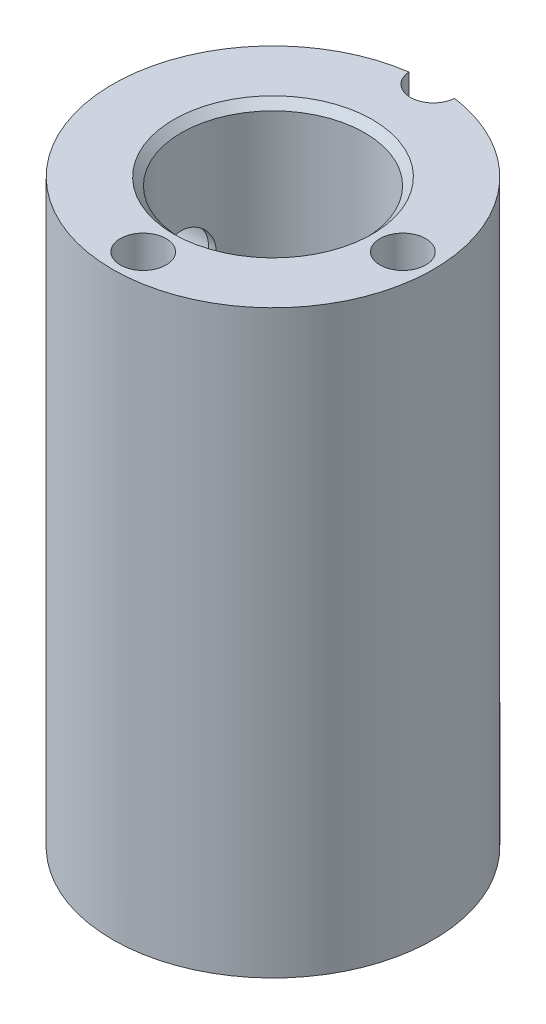
ISO-10303-21;
HEADER;
FILE_DESCRIPTION(('STEP AP214'),'2;1');
FILE_NAME('part.step','',(''),(''),'','','');
FILE_SCHEMA(('AUTOMOTIVE_DESIGN { 1 0 10303 214 1 1 1 1 }'));
ENDSEC;
DATA;
#1=APPLICATION_CONTEXT('core data for automotive mechanical design processes');
#2=APPLICATION_PROTOCOL_DEFINITION('international standard','automotive_design',2000,#1);
#3=PRODUCT_CONTEXT('',#1,'mechanical');
#4=PRODUCT('Part','Part','',(#3));
#5=PRODUCT_RELATED_PRODUCT_CATEGORY('part','',(#4));
#6=PRODUCT_DEFINITION_FORMATION('','',#4);
#7=PRODUCT_DEFINITION_CONTEXT('part definition',#1,'design');
#8=PRODUCT_DEFINITION('design','',#6,#7);
#9=PRODUCT_DEFINITION_SHAPE('','',#8);
#10=(LENGTH_UNIT() NAMED_UNIT(*) SI_UNIT(.MILLI.,.METRE.));
#11=(NAMED_UNIT(*) PLANE_ANGLE_UNIT() SI_UNIT($,.RADIAN.));
#12=(NAMED_UNIT(*) SI_UNIT($,.STERADIAN.) SOLID_ANGLE_UNIT());
#13=UNCERTAINTY_MEASURE_WITH_UNIT(LENGTH_MEASURE(1.E-05),#10,'distance_accuracy_value','');
#14=(GEOMETRIC_REPRESENTATION_CONTEXT(3) GLOBAL_UNCERTAINTY_ASSIGNED_CONTEXT((#13)) GLOBAL_UNIT_ASSIGNED_CONTEXT((#10,
#11,#12)) REPRESENTATION_CONTEXT('',''));
#15=CARTESIAN_POINT('',(0.,0.,0.));
#16=DIRECTION('',(0.,0.,1.));
#17=DIRECTION('',(1.,0.,0.));
#18=AXIS2_PLACEMENT_3D('',#15,#16,#17);
#19=CARTESIAN_POINT('',(0.,38.,0.));
#20=DIRECTION('',(0.,-1.,0.));
#21=DIRECTION('',(0.,0.,-1.));
#22=AXIS2_PLACEMENT_3D('',#19,#20,#21);
#23=CYLINDRICAL_SURFACE('',#22,10.5);
#24=CARTESIAN_POINT('',(-10.1980390271856,7.,2.5));
#25=CARTESIAN_POINT('',(-10.19804176628,6.86172652663562,2.49999571771621));
#26=CARTESIAN_POINT('',(-10.2008819480951,6.72340412660828,2.48848921004997));
#27=CARTESIAN_POINT('',(-10.2119100495576,6.45071622647227,2.44283138746475));
#28=CARTESIAN_POINT('',(-10.220101377256,6.31635330511972,2.40866564106247));
#29=CARTESIAN_POINT('',(-10.2408526576227,6.05556807045905,2.31884533433252));
#30=CARTESIAN_POINT('',(-10.2534073056611,5.92913633428162,2.26321685793814));
#31=CARTESIAN_POINT('',(-10.2814641264546,5.6873904161032,2.13212786900036));
#32=CARTESIAN_POINT('',(-10.2969663519875,5.57207643322669,2.05666700133913));
#33=CARTESIAN_POINT('',(-10.3295180748048,5.35353514341651,1.88644621865885));
#34=CARTESIAN_POINT('',(-10.3465903884589,5.25056256471987,1.79136356790472));
#35=CARTESIAN_POINT('',(-10.3801600371474,5.06186598464005,1.5852940689898));
#36=CARTESIAN_POINT('',(-10.3966573220513,4.97614348400937,1.47430583848448));
#37=CARTESIAN_POINT('',(-10.4274690302773,4.82335182577336,1.23784521107821));
#38=CARTESIAN_POINT('',(-10.4417533871947,4.75653085494883,1.11220818954147));
#39=CARTESIAN_POINT('',(-10.4662704926092,4.6450495742447,0.851089407039719));
#40=CARTESIAN_POINT('',(-10.4765037817733,4.60038630693333,0.715608962664379));
#41=CARTESIAN_POINT('',(-10.4916044652571,4.53529836938973,0.441302152334316));
#42=CARTESIAN_POINT('',(-10.4965673832561,4.51444167174176,0.302583647149305));
#43=CARTESIAN_POINT('',(-10.5009002595401,4.49620492239017,0.0235338053366231));
#44=CARTESIAN_POINT('',(-10.5002709707842,4.49882171011448,-0.116797311620909));
#45=CARTESIAN_POINT('',(-10.4935621966644,4.52714255285135,-0.392099723100524));
#46=CARTESIAN_POINT('',(-10.4875927382963,4.55238054861658,-0.527122043139074));
#47=CARTESIAN_POINT('',(-10.4710013525068,4.62448081973773,-0.790957522089011));
#48=CARTESIAN_POINT('',(-10.4603791910467,4.67134418289254,-0.919770368291501));
#49=CARTESIAN_POINT('',(-10.4355041622277,4.78575574021175,-1.16878421413462));
#50=CARTESIAN_POINT('',(-10.4212216064534,4.85347403438117,-1.28890397251028));
#51=CARTESIAN_POINT('',(-10.3905818447092,5.00754506665896,-1.51624078669456));
#52=CARTESIAN_POINT('',(-10.374224308387,5.09390077352069,-1.6234557826605));
#53=CARTESIAN_POINT('',(-10.3407488740336,5.28530950179743,-1.82471663379566));
#54=CARTESIAN_POINT('',(-10.3236221697636,5.39077013097475,-1.91837375712403));
#55=CARTESIAN_POINT('',(-10.2909102679344,5.61607975312487,-2.08675450345623));
#56=CARTESIAN_POINT('',(-10.2753251293859,5.73592929651244,-2.1614774018346));
#57=CARTESIAN_POINT('',(-10.2474324080862,5.98732368488548,-2.2900867389068));
#58=CARTESIAN_POINT('',(-10.2351383452793,6.11891389915707,-2.34388762597933));
#59=CARTESIAN_POINT('',(-10.2153979164771,6.38963266599714,-2.42848774223003));
#60=CARTESIAN_POINT('',(-10.2079506213779,6.52875976823537,-2.45929138004507));
#61=CARTESIAN_POINT('',(-10.19893984574,6.80701884452661,-2.49639439645703));
#62=CARTESIAN_POINT('',(-10.197239217194,6.94607029077637,-2.50326507643121));
#63=CARTESIAN_POINT('',(-10.199542325466,7.22333223882591,-2.49386437791222));
#64=CARTESIAN_POINT('',(-10.2035455908828,7.36154280917226,-2.47759491184764));
#65=CARTESIAN_POINT('',(-10.2166747399209,7.63113115581334,-2.42287468523351));
#66=CARTESIAN_POINT('',(-10.2257254112251,7.76257899877081,-2.38474937481524));
#67=CARTESIAN_POINT('',(-10.2478595881532,8.01721950322973,-2.28775715738406));
#68=CARTESIAN_POINT('',(-10.2609435364514,8.14041125677248,-2.22888797351603));
#69=CARTESIAN_POINT('',(-10.2899637467827,8.37748374675313,-2.09085863357308));
#70=CARTESIAN_POINT('',(-10.3059470466895,8.49115734336259,-2.01135280635273));
#71=CARTESIAN_POINT('',(-10.3388463052029,8.70375932913724,-1.83475008584269));
#72=CARTESIAN_POINT('',(-10.3557624019413,8.80268552638046,-1.7376505823279));
#73=CARTESIAN_POINT('',(-10.3890810399881,8.98526038154295,-1.52600920776177));
#74=CARTESIAN_POINT('',(-10.4054635166664,9.06851605165279,-1.41112459577114));
#75=CARTESIAN_POINT('',(-10.4354734525102,9.2145498767078,-1.16867118175169));
#76=CARTESIAN_POINT('',(-10.4491010508798,9.27732906642974,-1.0411030211099));
#77=CARTESIAN_POINT('',(-10.4719825592833,9.38011007607494,-0.777759722096252));
#78=CARTESIAN_POINT('',(-10.4812666193847,9.42026931895107,-0.642048766362469));
#79=CARTESIAN_POINT('',(-10.4945463869459,9.47715156048382,-0.365556678436378));
#80=CARTESIAN_POINT('',(-10.4985430143108,9.49387863588788,-0.224776432575972));
#81=CARTESIAN_POINT('',(-10.5007640857532,9.50321040681398,0.054151286345562));
#82=CARTESIAN_POINT('',(-10.4991279246782,9.49639762867579,0.192278471246818));
#83=CARTESIAN_POINT('',(-10.4905722340482,9.46016496577647,0.465359154899666));
#84=CARTESIAN_POINT('',(-10.4836528357027,9.43074564244962,0.600312732382121));
#85=CARTESIAN_POINT('',(-10.4653253573833,9.35043490994369,0.862668081323068));
#86=CARTESIAN_POINT('',(-10.4539374569212,9.29963995823566,0.990100880575025));
#87=CARTESIAN_POINT('',(-10.4278784920113,9.17810917695526,1.23470533202502));
#88=CARTESIAN_POINT('',(-10.413207049044,9.10737104813354,1.35187579903588));
#89=CARTESIAN_POINT('',(-10.3817664472831,8.94613669362576,1.57542398206672));
#90=CARTESIAN_POINT('',(-10.3649581831981,8.85523937903105,1.68150692589577));
#91=CARTESIAN_POINT('',(-10.3313272613068,8.65705775966169,1.87711202127358));
#92=CARTESIAN_POINT('',(-10.3145046009652,8.54976939789784,1.96663006063831));
#93=CARTESIAN_POINT('',(-10.2824361838365,8.31972055242543,2.12800456564131));
#94=CARTESIAN_POINT('',(-10.2672210222363,8.19673400861852,2.19954527971807));
#95=CARTESIAN_POINT('',(-10.2404903539045,7.94013893459385,2.32082794219708));
#96=CARTESIAN_POINT('',(-10.2289719799267,7.80653873720579,2.37058679567045));
#97=CARTESIAN_POINT('',(-10.2128715845903,7.56084747459062,2.43889389955241));
#98=CARTESIAN_POINT('',(-10.2073492174717,7.44999882975006,2.4617611938327));
#99=CARTESIAN_POINT('',(-10.1999319441581,7.22611092774597,2.49231547049873));
#100=CARTESIAN_POINT('',(-10.1980367873171,7.11307182249207,2.50000350179699));
#101=CARTESIAN_POINT('',(-10.1980390271856,7.,2.5));
#102=B_SPLINE_CURVE_WITH_KNOTS('',3,(#24,#25,#26,#27,#28,#29,#30,#31,#32,#33,#34,#35,#36,#37,
#38,#39,#40,#41,#42,#43,#44,#45,#46,#47,#48,#49,#50,#51,#52,#53,#54,#55,#56,#57,#58,#59,#60,#61,
#62,#63,#64,#65,#66,#67,#68,#69,#70,#71,#72,#73,#74,#75,#76,#77,#78,#79,#80,#81,#82,#83,#84,#85,
#86,#87,#88,#89,#90,#91,#92,#93,#94,#95,#96,#97,#98,#99,#100,#101),.UNSPECIFIED.,.T.,.F.,(4,2,2,
2,2,2,2,2,2,2,2,2,2,2,2,2,2,2,2,2,2,2,2,2,2,2,2,2,2,2,2,2,2,2,2,2,2,2,4),(0.,0.414405530369437,
0.82907524600382,1.24324258756564,1.65741734569275,2.07904230944008,2.50070393861086,
2.92766929281861,3.35457764378792,3.77360899166427,4.1925839201863,4.6031203275838,
5.01367738802871,5.42767599099182,5.84174058852629,6.26598867755214,6.69025300038529,
7.11623437320497,7.54213406322265,7.95779473486284,8.37342105602115,8.78301344369068,
9.1926508023809,9.60965052687986,10.0267121688371,10.4531399747409,10.8795462278208,
11.3029470417974,11.7262741830055,12.1392013146111,12.5521181914893,12.9631914306563,
13.3743120818603,13.7944933954115,14.2147788780904,14.6419983436025,15.0688856503609,
15.4077852650483,15.7466614603846),.UNSPECIFIED.);
#103=CARTESIAN_POINT('',(-10.1980390271856,7.,2.5));
#104=VERTEX_POINT('',#103);
#105=EDGE_CURVE('E126',#104,#104,#102,.T.);
#106=ORIENTED_EDGE('',*,*,#105,.T.);
#107=EDGE_LOOP('',(#106));
#108=FACE_BOUND('',#107,.T.);
#109=CARTESIAN_POINT('',(-10.1980390271856,30.,2.5));
#110=CARTESIAN_POINT('',(-10.1980417662799,29.8617265266356,2.49999571771621));
#111=CARTESIAN_POINT('',(-10.2008819480951,29.7234041266083,2.48848921004997));
#112=CARTESIAN_POINT('',(-10.2119100495576,29.4507162264723,2.44283138746475));
#113=CARTESIAN_POINT('',(-10.220101377256,29.3163533051197,2.40866564106248));
#114=CARTESIAN_POINT('',(-10.2408526576227,29.055568070459,2.31884533433252));
#115=CARTESIAN_POINT('',(-10.2534073056611,28.9291363342816,2.26321685793814));
#116=CARTESIAN_POINT('',(-10.2814641264546,28.6873904161032,2.13212786900036));
#117=CARTESIAN_POINT('',(-10.2969663519875,28.5720764332267,2.05666700133913));
#118=CARTESIAN_POINT('',(-10.3295180748048,28.3535351434165,1.88644621865885));
#119=CARTESIAN_POINT('',(-10.3465903884589,28.2505625647199,1.79136356790472));
#120=CARTESIAN_POINT('',(-10.3801600371474,28.06186598464,1.5852940689898));
#121=CARTESIAN_POINT('',(-10.3966573220513,27.9761434840094,1.47430583848448));
#122=CARTESIAN_POINT('',(-10.4274690302773,27.8233518257734,1.2378452110782));
#123=CARTESIAN_POINT('',(-10.4417533871947,27.7565308549488,1.11220818954147));
#124=CARTESIAN_POINT('',(-10.4662704926092,27.6450495742447,0.851089407039719));
#125=CARTESIAN_POINT('',(-10.4765037817733,27.6003863069333,0.71560896266438));
#126=CARTESIAN_POINT('',(-10.4916044652571,27.5352983693897,0.441302152334317));
#127=CARTESIAN_POINT('',(-10.4965673832561,27.5144416717418,0.302583647149306));
#128=CARTESIAN_POINT('',(-10.5009002595401,27.4962049223902,0.0235338053366235));
#129=CARTESIAN_POINT('',(-10.5002709707842,27.4988217101145,-0.116797311620909));
#130=CARTESIAN_POINT('',(-10.4935621966644,27.5271425528514,-0.392099723100525));
#131=CARTESIAN_POINT('',(-10.4875927382963,27.5523805486166,-0.527122043139074));
#132=CARTESIAN_POINT('',(-10.4710013525068,27.6244808197377,-0.790957522089012));
#133=CARTESIAN_POINT('',(-10.4603791910467,27.6713441828925,-0.919770368291503));
#134=CARTESIAN_POINT('',(-10.4355041622277,27.7857557402117,-1.16878421413462));
#135=CARTESIAN_POINT('',(-10.4212216064534,27.8534740343812,-1.28890397251028));
#136=CARTESIAN_POINT('',(-10.3905818447092,28.007545066659,-1.51624078669456));
#137=CARTESIAN_POINT('',(-10.374224308387,28.0939007735207,-1.62345578266051));
#138=CARTESIAN_POINT('',(-10.3407488740336,28.2853095017974,-1.82471663379567));
#139=CARTESIAN_POINT('',(-10.3236221697636,28.3907701309747,-1.91837375712403));
#140=CARTESIAN_POINT('',(-10.2909102679344,28.6160797531249,-2.08675450345624));
#141=CARTESIAN_POINT('',(-10.2753251293859,28.7359292965124,-2.1614774018346));
#142=CARTESIAN_POINT('',(-10.2474324080862,28.9873236848855,-2.2900867389068));
#143=CARTESIAN_POINT('',(-10.2351383452793,29.1189138991571,-2.34388762597934));
#144=CARTESIAN_POINT('',(-10.2153979164771,29.3896326659971,-2.42848774223003));
#145=CARTESIAN_POINT('',(-10.2079506213779,29.5287597682354,-2.45929138004507));
#146=CARTESIAN_POINT('',(-10.19893984574,29.8070188445266,-2.49639439645703));
#147=CARTESIAN_POINT('',(-10.197239217194,29.9460702907764,-2.50326507643122));
#148=CARTESIAN_POINT('',(-10.199542325466,30.2233322388259,-2.49386437791222));
#149=CARTESIAN_POINT('',(-10.2035455908828,30.3615428091723,-2.47759491184765));
#150=CARTESIAN_POINT('',(-10.2166747399209,30.6311311558133,-2.42287468523351));
#151=CARTESIAN_POINT('',(-10.2257254112251,30.7625789987708,-2.38474937481524));
#152=CARTESIAN_POINT('',(-10.2478595881532,31.0172195032297,-2.28775715738406));
#153=CARTESIAN_POINT('',(-10.2609435364514,31.1404112567725,-2.22888797351604));
#154=CARTESIAN_POINT('',(-10.2899637467827,31.3774837467531,-2.09085863357308));
#155=CARTESIAN_POINT('',(-10.3059470466895,31.4911573433626,-2.01135280635273));
#156=CARTESIAN_POINT('',(-10.3388463052029,31.7037593291372,-1.8347500858427));
#157=CARTESIAN_POINT('',(-10.3557624019413,31.8026855263805,-1.73765058232791));
#158=CARTESIAN_POINT('',(-10.3890810399881,31.985260381543,-1.52600920776177));
#159=CARTESIAN_POINT('',(-10.4054635166664,32.0685160516528,-1.41112459577114));
#160=CARTESIAN_POINT('',(-10.4354734525102,32.2145498767078,-1.16867118175169));
#161=CARTESIAN_POINT('',(-10.4491010508798,32.2773290664297,-1.0411030211099));
#162=CARTESIAN_POINT('',(-10.4719825592833,32.3801100760749,-0.777759722096253));
#163=CARTESIAN_POINT('',(-10.4812666193847,32.4202693189511,-0.642048766362469));
#164=CARTESIAN_POINT('',(-10.4945463869459,32.4771515604838,-0.365556678436377));
#165=CARTESIAN_POINT('',(-10.4985430143108,32.4938786358879,-0.22477643257597));
#166=CARTESIAN_POINT('',(-10.5007640857532,32.503210406814,0.0541512863455645));
#167=CARTESIAN_POINT('',(-10.4991279246782,32.4963976286758,0.192278471246821));
#168=CARTESIAN_POINT('',(-10.4905722340482,32.4601649657765,0.465359154899669));
#169=CARTESIAN_POINT('',(-10.4836528357027,32.4307456424496,0.600312732382124));
#170=CARTESIAN_POINT('',(-10.4653253573833,32.3504349099437,0.862668081323071));
#171=CARTESIAN_POINT('',(-10.4539374569212,32.2996399582357,0.990100880575028));
#172=CARTESIAN_POINT('',(-10.4278784920113,32.1781091769553,1.23470533202502));
#173=CARTESIAN_POINT('',(-10.413207049044,32.1073710481335,1.35187579903588));
#174=CARTESIAN_POINT('',(-10.3817664472831,31.9461366936258,1.57542398206672));
#175=CARTESIAN_POINT('',(-10.3649581831981,31.8552393790311,1.68150692589578));
#176=CARTESIAN_POINT('',(-10.3313272613068,31.6570577596617,1.87711202127358));
#177=CARTESIAN_POINT('',(-10.3145046009652,31.5497693978978,1.96663006063831));
#178=CARTESIAN_POINT('',(-10.2824361838365,31.3197205524254,2.12800456564132));
#179=CARTESIAN_POINT('',(-10.2672210222363,31.1967340086185,2.19954527971807));
#180=CARTESIAN_POINT('',(-10.2404903539045,30.9401389345938,2.32082794219708));
#181=CARTESIAN_POINT('',(-10.2289719799267,30.8065387372058,2.37058679567045));
#182=CARTESIAN_POINT('',(-10.2128715845903,30.5608474745906,2.43889389955241));
#183=CARTESIAN_POINT('',(-10.2073492174717,30.4499988297501,2.4617611938327));
#184=CARTESIAN_POINT('',(-10.1999319441581,30.226110927746,2.49231547049874));
#185=CARTESIAN_POINT('',(-10.1980367873171,30.1130718224921,2.50000350179699));
#186=CARTESIAN_POINT('',(-10.1980390271856,30.,2.5));
#187=B_SPLINE_CURVE_WITH_KNOTS('',3,(#109,#110,#111,#112,#113,#114,#115,#116,#117,#118,#119,
#120,#121,#122,#123,#124,#125,#126,#127,#128,#129,#130,#131,#132,#133,#134,#135,#136,#137,#138,
#139,#140,#141,#142,#143,#144,#145,#146,#147,#148,#149,#150,#151,#152,#153,#154,#155,#156,#157,
#158,#159,#160,#161,#162,#163,#164,#165,#166,#167,#168,#169,#170,#171,#172,#173,#174,#175,#176,
#177,#178,#179,#180,#181,#182,#183,#184,#185,#186),.UNSPECIFIED.,.T.,.F.,(4,2,2,2,2,2,2,2,2,2,2,
2,2,2,2,2,2,2,2,2,2,2,2,2,2,2,2,2,2,2,2,2,2,2,2,2,2,2,4),(0.,0.414405530369436,
0.829075246003822,1.24324258756564,1.65741734569276,2.07904230944008,2.50070393861086,
2.92766929281861,3.35457764378793,3.77360899166428,4.1925839201863,4.6031203275838,
5.01367738802872,5.42767599099183,5.84174058852629,6.26598867755215,6.6902530003853,
7.11623437320498,7.54213406322266,7.95779473486285,8.37342105602115,8.78301344369069,
9.1926508023809,9.60965052687986,10.0267121688371,10.4531399747409,10.8795462278208,
11.3029470417974,11.7262741830055,12.1392013146111,12.5521181914893,12.9631914306563,
13.3743120818603,13.7944933954115,14.2147788780904,14.6419983436025,15.0688856503609,
15.4077852650483,15.7466614603846),.UNSPECIFIED.);
#188=CARTESIAN_POINT('',(-10.1980390271856,30.,2.5));
#189=VERTEX_POINT('',#188);
#190=EDGE_CURVE('E134',#189,#189,#187,.T.);
#191=ORIENTED_EDGE('',*,*,#190,.T.);
#192=EDGE_LOOP('',(#191));
#193=FACE_BOUND('',#192,.T.);
#194=CARTESIAN_POINT('',(0.,29.0987090714587,-10.5));
#195=CARTESIAN_POINT('',(6.25412845202244E-06,29.0987128293182,-10.5));
#196=CARTESIAN_POINT('',(1.25082569041346E-05,29.0987165871776,-10.4999999999944));
#197=CARTESIAN_POINT('',(7.59068720753266E-05,29.0987546809088,-10.4999999998811));
#198=CARTESIAN_POINT('',(0.000133051358798381,29.0987890167805,-10.4999999993125));
#199=CARTESIAN_POINT('',(0.000418773792358579,29.0989606961388,-10.499999994137));
#200=CARTESIAN_POINT('',(0.000647351738780727,29.0990980396253,-10.4999999825326));
#201=CARTESIAN_POINT('',(0.00179024147799292,29.0997847570621,-10.4999998871904));
#202=CARTESIAN_POINT('',(0.00270455327596662,29.1003341310152,-10.4999996914913));
#203=CARTESIAN_POINT('',(0.00727611228695513,29.1030810008957,-10.4999981158956));
#204=CARTESIAN_POINT('',(0.0109333585318476,29.1052784965475,-10.4999949446987));
#205=CARTESIAN_POINT('',(0.0292196058945068,29.1162659904709,-10.4999695340755));
#206=CARTESIAN_POINT('',(0.0438485894116939,29.1250559960695,-10.4999186307338));
#207=CARTESIAN_POINT('',(0.116993977897106,29.16900669047,-10.4995112713346));
#208=CARTESIAN_POINT('',(0.175507570055379,29.2041668395834,-10.4986962871931));
#209=CARTESIAN_POINT('',(0.468127241522992,29.3800232427756,-10.4921725775722));
#210=CARTESIAN_POINT('',(0.702117515733291,29.5207237046427,-10.4791174813745));
#211=CARTESIAN_POINT('',(1.18474491162777,29.8115836831315,-10.4359490505261));
#212=CARTESIAN_POINT('',(1.43328875873557,29.9617317085154,-10.4047296760414));
#213=CARTESIAN_POINT('',(1.92775851961316,30.2617474614247,-10.3245578466065));
#214=CARTESIAN_POINT('',(2.17368380457196,30.4116151148048,-10.2756012269433));
#215=CARTESIAN_POINT('',(2.66235861869594,30.7113145106083,-10.1599730025506));
#216=CARTESIAN_POINT('',(2.90509713337987,30.861144939982,-10.0932514371379));
#217=CARTESIAN_POINT('',(3.38544970932257,31.1601676613349,-9.94244222182494));
#218=CARTESIAN_POINT('',(3.62306474528467,31.3093600702851,-9.85835790783111));
#219=CARTESIAN_POINT('',(3.85754842471769,31.4581751485542,-9.76572169125039));
#220=B_SPLINE_CURVE_WITH_KNOTS('',3,(#194,#195,#196,#197,#198,#199,#200,#201,#202,#203,#204,
#205,#206,#207,#208,#209,#210,#211,#212,#213,#214,#215,#216,#217,#218,#219),.UNSPECIFIED.,.F.,
.F.,(4,2,2,2,2,2,2,2,2,2,2,2,4),(0.,2.18888253667333E-05,0.000221888825371918,
0.00102188882568404,0.00422188884573947,0.0170218901293227,0.0682219722791422,0.273027230401927,
1.09256429861,1.96817569938757,2.84399282748443,3.7222995359928,4.60043765210729),.UNSPECIFIED.);
#221=CARTESIAN_POINT('',(0.,29.0987090714587,-10.5));
#222=VERTEX_POINT('',#221);
#223=CARTESIAN_POINT('',(1.49616857611809,30.,-10.3928571428571));
#224=VERTEX_POINT('',#223);
#225=EDGE_CURVE('E50',#222,#224,#220,.T.);
#226=ORIENTED_EDGE('',*,*,#225,.T.);
#227=DIRECTION('',(0.,1.,0.));
#228=VECTOR('',#227,1.);
#229=CARTESIAN_POINT('',(1.49616857611809,34.,-10.3928571428571));
#230=LINE('',#229,#228);
#231=CARTESIAN_POINT('',(1.49616857611809,38.,-10.3928571428571));
#232=VERTEX_POINT('',#231);
#233=EDGE_CURVE('E38',#224,#232,#230,.T.);
#234=ORIENTED_EDGE('',*,*,#233,.T.);
#235=CARTESIAN_POINT('',(0.,38.,0.));
#236=DIRECTION('',(0.,1.,0.));
#237=DIRECTION('',(0.,0.,1.));
#238=AXIS2_PLACEMENT_3D('',#235,#236,#237);
#239=CIRCLE('',#238,10.5);
#240=CARTESIAN_POINT('',(-1.49616857611809,38.,-10.3928571428571));
#241=VERTEX_POINT('',#240);
#242=EDGE_CURVE('E173',#241,#232,#239,.T.);
#243=ORIENTED_EDGE('',*,*,#242,.F.);
#244=DIRECTION('',(0.,1.,0.));
#245=VECTOR('',#244,1.);
#246=CARTESIAN_POINT('',(-1.49616857611809,34.,-10.3928571428571));
#247=LINE('',#246,#245);
#248=CARTESIAN_POINT('',(-1.49616857611809,30.,-10.3928571428571));
#249=VERTEX_POINT('',#248);
#250=EDGE_CURVE('E77',#241,#249,#247,.F.);
#251=ORIENTED_EDGE('',*,*,#250,.T.);
#252=CARTESIAN_POINT('',(0.,29.0987090714587,-10.5));
#253=CARTESIAN_POINT('',(-6.25412845202244E-06,29.0987128293182,-10.5));
#254=CARTESIAN_POINT('',(-1.25082569041346E-05,29.0987165871776,-10.4999999999944));
#255=CARTESIAN_POINT('',(-7.59068720753266E-05,29.0987546809088,-10.4999999998811));
#256=CARTESIAN_POINT('',(-0.000133051358798381,29.0987890167805,-10.4999999993125));
#257=CARTESIAN_POINT('',(-0.000418773792358579,29.0989606961388,-10.499999994137));
#258=CARTESIAN_POINT('',(-0.000647351738780727,29.0990980396253,-10.4999999825326));
#259=CARTESIAN_POINT('',(-0.00179024147799292,29.0997847570621,-10.4999998871904));
#260=CARTESIAN_POINT('',(-0.00270455327596662,29.1003341310152,-10.4999996914913));
#261=CARTESIAN_POINT('',(-0.00727611228695513,29.1030810008957,-10.4999981158956));
#262=CARTESIAN_POINT('',(-0.0109333585318476,29.1052784965475,-10.4999949446987));
#263=CARTESIAN_POINT('',(-0.0292196058945068,29.1162659904709,-10.4999695340755));
#264=CARTESIAN_POINT('',(-0.0438485894116939,29.1250559960695,-10.4999186307338));
#265=CARTESIAN_POINT('',(-0.116993977897106,29.16900669047,-10.4995112713346));
#266=CARTESIAN_POINT('',(-0.175507570055379,29.2041668395834,-10.4986962871931));
#267=CARTESIAN_POINT('',(-0.468127241522992,29.3800232427756,-10.4921725775722));
#268=CARTESIAN_POINT('',(-0.702117515733291,29.5207237046427,-10.4791174813745));
#269=CARTESIAN_POINT('',(-1.18474491162777,29.8115836831315,-10.4359490505261));
#270=CARTESIAN_POINT('',(-1.43328875873557,29.9617317085154,-10.4047296760414));
#271=CARTESIAN_POINT('',(-1.92775851961316,30.2617474614247,-10.3245578466065));
#272=CARTESIAN_POINT('',(-2.17368380457196,30.4116151148048,-10.2756012269433));
#273=CARTESIAN_POINT('',(-2.66235861869594,30.7113145106083,-10.1599730025506));
#274=CARTESIAN_POINT('',(-2.90509713337987,30.861144939982,-10.0932514371379));
#275=CARTESIAN_POINT('',(-3.38544970932257,31.1601676613349,-9.94244222182494));
#276=CARTESIAN_POINT('',(-3.62306474528467,31.3093600702851,-9.85835790783111));
#277=CARTESIAN_POINT('',(-3.85754842471769,31.4581751485542,-9.76572169125039));
#278=B_SPLINE_CURVE_WITH_KNOTS('',3,(#252,#253,#254,#255,#256,#257,#258,#259,#260,#261,#262,
#263,#264,#265,#266,#267,#268,#269,#270,#271,#272,#273,#274,#275,#276,#277),.UNSPECIFIED.,.F.,
.F.,(4,2,2,2,2,2,2,2,2,2,2,2,4),(0.,2.18888253667333E-05,0.000221888825371918,
0.00102188882568404,0.00422188884573947,0.0170218901293227,0.0682219722791422,0.273027230401927,
1.09256429861,1.96817569938757,2.84399282748443,3.7222995359928,4.60043765210729),.UNSPECIFIED.);
#279=EDGE_CURVE('E79',#249,#222,#278,.F.);
#280=ORIENTED_EDGE('',*,*,#279,.T.);
#281=EDGE_LOOP('',(#226,#234,#243,#251,#280));
#282=FACE_BOUND('',#281,.T.);
#283=CARTESIAN_POINT('',(0.,0.,0.));
#284=DIRECTION('',(0.,1.,0.));
#285=DIRECTION('',(0.,0.,1.));
#286=AXIS2_PLACEMENT_3D('',#283,#284,#285);
#287=CIRCLE('',#286,10.5);
#288=CARTESIAN_POINT('',(0.,0.,10.5));
#289=VERTEX_POINT('',#288);
#290=EDGE_CURVE('E170',#289,#289,#287,.T.);
#291=ORIENTED_EDGE('',*,*,#290,.T.);
#292=EDGE_LOOP('',(#291));
#293=FACE_BOUND('',#292,.T.);
#294=ADVANCED_FACE('F34',(#108,#193,#282,#293),#23,.T.);
#295=CARTESIAN_POINT('',(0.,38.,0.));
#296=DIRECTION('',(0.,1.,0.));
#297=DIRECTION('',(0.,0.,1.));
#298=AXIS2_PLACEMENT_3D('',#295,#296,#297);
#299=PLANE('',#298);
#300=CARTESIAN_POINT('',(0.,38.,-10.5));
#301=DIRECTION('',(0.,1.,0.));
#302=DIRECTION('',(0.,0.,1.));
#303=AXIS2_PLACEMENT_3D('',#300,#301,#302);
#304=CIRCLE('',#303,1.49999999999999);
#305=EDGE_CURVE('E11',#241,#232,#304,.T.);
#306=ORIENTED_EDGE('',*,*,#305,.F.);
#307=ORIENTED_EDGE('',*,*,#242,.T.);
#308=EDGE_LOOP('',(#306,#307));
#309=FACE_BOUND('',#308,.T.);
#310=CARTESIAN_POINT('',(0.,38.,0.));
#311=DIRECTION('',(0.,1.,0.));
#312=DIRECTION('',(0.,0.,1.));
#313=AXIS2_PLACEMENT_3D('',#310,#311,#312);
#314=CIRCLE('',#313,6.49999999999999);
#315=CARTESIAN_POINT('',(0.,38.,6.49999999999999));
#316=VERTEX_POINT('',#315);
#317=EDGE_CURVE('E84',#316,#316,#314,.F.);
#318=ORIENTED_EDGE('',*,*,#317,.T.);
#319=EDGE_LOOP('',(#318));
#320=FACE_BOUND('',#319,.T.);
#321=CARTESIAN_POINT('',(8.5,38.,0.));
#322=DIRECTION('',(0.,1.,0.));
#323=DIRECTION('',(0.,0.,1.));
#324=AXIS2_PLACEMENT_3D('',#321,#322,#323);
#325=CIRCLE('',#324,1.5);
#326=CARTESIAN_POINT('',(8.5,38.,1.5));
#327=VERTEX_POINT('',#326);
#328=EDGE_CURVE('E80',#327,#327,#325,.T.);
#329=ORIENTED_EDGE('',*,*,#328,.F.);
#330=EDGE_LOOP('',(#329));
#331=FACE_BOUND('',#330,.T.);
#332=CARTESIAN_POINT('',(0.,38.,8.5));
#333=DIRECTION('',(0.,1.,0.));
#334=DIRECTION('',(0.,0.,1.));
#335=AXIS2_PLACEMENT_3D('',#332,#333,#334);
#336=CIRCLE('',#335,1.5);
#337=CARTESIAN_POINT('',(0.,38.,10.));
#338=VERTEX_POINT('',#337);
#339=EDGE_CURVE('E339',#338,#338,#336,.T.);
#340=ORIENTED_EDGE('',*,*,#339,.F.);
#341=EDGE_LOOP('',(#340));
#342=FACE_BOUND('',#341,.T.);
#343=ADVANCED_FACE('F146',(#309,#320,#331,#342),#299,.T.);
#344=CARTESIAN_POINT('',(0.,0.,0.));
#345=DIRECTION('',(0.,1.,0.));
#346=DIRECTION('',(0.,0.,1.));
#347=AXIS2_PLACEMENT_3D('',#344,#345,#346);
#348=PLANE('',#347);
#349=CARTESIAN_POINT('',(0.,0.,0.));
#350=DIRECTION('',(0.,1.,0.));
#351=DIRECTION('',(0.,0.,1.));
#352=AXIS2_PLACEMENT_3D('',#349,#350,#351);
#353=CIRCLE('',#352,6.);
#354=CARTESIAN_POINT('',(0.,0.,6.));
#355=VERTEX_POINT('',#354);
#356=EDGE_CURVE('E168',#355,#355,#353,.T.);
#357=ORIENTED_EDGE('',*,*,#356,.T.);
#358=EDGE_LOOP('',(#357));
#359=FACE_BOUND('',#358,.T.);
#360=ORIENTED_EDGE('',*,*,#290,.F.);
#361=EDGE_LOOP('',(#360));
#362=FACE_BOUND('',#361,.T.);
#363=ADVANCED_FACE('F157',(#359,#362),#348,.F.);
#364=CARTESIAN_POINT('',(0.,0.,0.));
#365=DIRECTION('',(0.,1.,0.));
#366=DIRECTION('',(0.,0.,1.));
#367=AXIS2_PLACEMENT_3D('',#364,#365,#366);
#368=CYLINDRICAL_SURFACE('',#367,6.);
#369=CARTESIAN_POINT('',(0.,37.5,0.));
#370=DIRECTION('',(0.,1.,0.));
#371=DIRECTION('',(0.,0.,1.));
#372=AXIS2_PLACEMENT_3D('',#369,#370,#371);
#373=CIRCLE('',#372,6.);
#374=CARTESIAN_POINT('',(0.,37.5,6.));
#375=VERTEX_POINT('',#374);
#376=EDGE_CURVE('E133',#375,#375,#373,.T.);
#377=ORIENTED_EDGE('',*,*,#376,.T.);
#378=EDGE_LOOP('',(#377));
#379=FACE_BOUND('',#378,.T.);
#380=CARTESIAN_POINT('',(-5.67428409581332,7.,1.95));
#381=CARTESIAN_POINT('',(-5.67428419157679,7.10637971858013,1.94999997956254));
#382=CARTESIAN_POINT('',(-5.67730836924918,7.21276064743233,1.94126540346461));
#383=CARTESIAN_POINT('',(-5.68901933991831,7.42238153946553,1.9066683803243));
#384=CARTESIAN_POINT('',(-5.69770730301376,7.52562084899583,1.88080239403398));
#385=CARTESIAN_POINT('',(-5.71966010839931,7.72588967077862,1.81293845258239));
#386=CARTESIAN_POINT('',(-5.73291633378434,7.8229304694036,1.7709708523913));
#387=CARTESIAN_POINT('',(-5.76249971808928,8.00862357288995,1.67219771633392));
#388=CARTESIAN_POINT('',(-5.77882750097674,8.09727416782463,1.61538916470884));
#389=CARTESIAN_POINT('',(-5.81339505944507,8.2669661212842,1.48628462647115));
#390=CARTESIAN_POINT('',(-5.83168075370936,8.34764990266521,1.41353083017882));
#391=CARTESIAN_POINT('',(-5.86771462130831,8.49591338027478,1.25557910696733));
#392=CARTESIAN_POINT('',(-5.88546271269449,8.56349108710141,1.17037929427382));
#393=CARTESIAN_POINT('',(-5.91895069368436,8.68522840356604,0.987357616777755));
#394=CARTESIAN_POINT('',(-5.93463025695413,8.73901596288427,0.889276270841936));
#395=CARTESIAN_POINT('',(-5.96167544510031,8.82918937712735,0.684861796762607));
#396=CARTESIAN_POINT('',(-5.97304217157101,8.86557967631704,0.57853078413617));
#397=CARTESIAN_POINT('',(-5.98985580757842,8.91872060743435,0.364382385278352));
#398=CARTESIAN_POINT('',(-5.995486745164,8.93608322878634,0.25673158036636));
#399=CARTESIAN_POINT('',(-6.00084625397066,8.95261905137597,0.0399072225737635));
#400=CARTESIAN_POINT('',(-6.00057627320317,8.9517967149738,-0.0692659501657157));
#401=CARTESIAN_POINT('',(-5.99429047077462,8.93238001433374,-0.281714262870053));
#402=CARTESIAN_POINT('',(-5.98848939117047,8.91444983487713,-0.38505748976424));
#403=CARTESIAN_POINT('',(-5.97206057668621,8.8624212950399,-0.587179347840954));
#404=CARTESIAN_POINT('',(-5.96143251919655,8.82832185398506,-0.685957673443501));
#405=CARTESIAN_POINT('',(-5.93626446721242,8.74451926828016,-0.877630558537068));
#406=CARTESIAN_POINT('',(-5.92167615713337,8.69462204745769,-0.970433658745757));
#407=CARTESIAN_POINT('',(-5.89011369554283,8.58079846292705,-1.14655015877172));
#408=CARTESIAN_POINT('',(-5.87313890469887,8.51686833725281,-1.22986100477355));
#409=CARTESIAN_POINT('',(-5.83770063644897,8.37342080359893,-1.38858329630848));
#410=CARTESIAN_POINT('',(-5.81920453803594,8.29333250156324,-1.46347224562404));
#411=CARTESIAN_POINT('',(-5.78345691816434,8.12156974569558,-1.59892014212824));
#412=CARTESIAN_POINT('',(-5.76620556954841,8.02989368766359,-1.65947710186673));
#413=CARTESIAN_POINT('',(-5.7347277338005,7.83597551648405,-1.76521762809217));
#414=CARTESIAN_POINT('',(-5.72054334653649,7.73361186508605,-1.81019178367558));
#415=CARTESIAN_POINT('',(-5.69729516709383,7.52218919365386,-1.88209256477123));
#416=CARTESIAN_POINT('',(-5.68822935524865,7.41313283325972,-1.90902630937775));
#417=CARTESIAN_POINT('',(-5.67669827372123,7.19645947633271,-1.94304072329696));
#418=CARTESIAN_POINT('',(-5.67396521621919,7.08898322612603,-1.9509274651986));
#419=CARTESIAN_POINT('',(-5.67466259724453,6.87423021895681,-1.94889903745894));
#420=CARTESIAN_POINT('',(-5.67809198602877,6.76695343113287,-1.93898689977156));
#421=CARTESIAN_POINT('',(-5.69046192451847,6.55923045979844,-1.90236484314116));
#422=CARTESIAN_POINT('',(-5.6992220710146,6.45867555258704,-1.876204228721));
#423=CARTESIAN_POINT('',(-5.72107099101545,6.26339893559262,-1.8084811564746));
#424=CARTESIAN_POINT('',(-5.73416050749403,6.16867823034335,-1.76691605489867));
#425=CARTESIAN_POINT('',(-5.76368832963708,5.98455810062024,-1.66812017421398));
#426=CARTESIAN_POINT('',(-5.78021661831198,5.89540918256553,-1.61045014737358));
#427=CARTESIAN_POINT('',(-5.81458035444243,5.72776165939595,-1.48158529174781));
#428=CARTESIAN_POINT('',(-5.83241616790438,5.64926605405733,-1.41038666704802));
#429=CARTESIAN_POINT('',(-5.8683642837977,5.5014754395271,-1.2526470481596));
#430=CARTESIAN_POINT('',(-5.88645241804396,5.43275942251938,-1.16555653785565));
#431=CARTESIAN_POINT('',(-5.92006473710861,5.31088566236594,-0.980638389712768));
#432=CARTESIAN_POINT('',(-5.93558902513978,5.25772729284924,-0.882811184365152));
#433=CARTESIAN_POINT('',(-5.96224467390227,5.16897636907163,-0.67973607782165));
#434=CARTESIAN_POINT('',(-5.97340604714411,5.13326336737702,-0.574544962840838));
#435=CARTESIAN_POINT('',(-5.99020903241069,5.08017014524935,-0.359218520765515));
#436=CARTESIAN_POINT('',(-5.99585252796995,5.06278366887546,-0.249084894239384));
#437=CARTESIAN_POINT('',(-6.00084874467005,5.0473780443715,-0.0323090029994694));
#438=CARTESIAN_POINT('',(-6.00047210566006,5.04852570467934,0.0742684778836123));
#439=CARTESIAN_POINT('',(-5.99412936521759,5.06811692766082,0.285642004482861));
#440=CARTESIAN_POINT('',(-5.98816368008375,5.08655920214973,0.390438182287019));
#441=CARTESIAN_POINT('',(-5.97140701123228,5.13967193095694,0.593772532545648));
#442=CARTESIAN_POINT('',(-5.96068708024961,5.17410376388322,0.69237930412112));
#443=CARTESIAN_POINT('',(-5.93552601019835,5.25799967230395,0.882458500802348));
#444=CARTESIAN_POINT('',(-5.9210842105068,5.30746641673975,0.973929655594216));
#445=CARTESIAN_POINT('',(-5.88933226897117,5.42206867155469,1.15070513492441));
#446=CARTESIAN_POINT('',(-5.87193801027252,5.48770132456701,1.23567187378725));
#447=CARTESIAN_POINT('',(-5.83646132775741,5.63191414307659,1.39365978067048));
#448=CARTESIAN_POINT('',(-5.81837869127326,5.71049833520383,1.46667721954205));
#449=CARTESIAN_POINT('',(-5.78277908370911,5.88183268658662,1.60140772636668));
#450=CARTESIAN_POINT('',(-5.76530717176609,5.9749966435242,1.66260807143323));
#451=CARTESIAN_POINT('',(-5.73373535295916,6.17082456587933,1.76842982084833));
#452=CARTESIAN_POINT('',(-5.71963436347518,6.27348546648613,1.8130565506067));
#453=CARTESIAN_POINT('',(-5.6973020091658,6.47892525047359,1.8820169667178));
#454=CARTESIAN_POINT('',(-5.68876278734254,6.58130794557392,1.90743063240748));
#455=CARTESIAN_POINT('',(-5.67725462394959,6.7891273185847,1.94141961769172));
#456=CARTESIAN_POINT('',(-5.67428400089856,6.89456306483474,1.95000002025633));
#457=CARTESIAN_POINT('',(-5.67428409581332,7.,1.95));
#458=B_SPLINE_CURVE_WITH_KNOTS('',3,(#380,#381,#382,#383,#384,#385,#386,#387,#388,#389,#390,
#391,#392,#393,#394,#395,#396,#397,#398,#399,#400,#401,#402,#403,#404,#405,#406,#407,#408,#409,
#410,#411,#412,#413,#414,#415,#416,#417,#418,#419,#420,#421,#422,#423,#424,#425,#426,#427,#428,
#429,#430,#431,#432,#433,#434,#435,#436,#437,#438,#439,#440,#441,#442,#443,#444,#445,#446,#447,
#448,#449,#450,#451,#452,#453,#454,#455,#456,#457),.UNSPECIFIED.,.T.,.F.,(4,2,2,2,2,2,2,2,2,2,2,
2,2,2,2,2,2,2,2,2,2,2,2,2,2,2,2,2,2,2,2,2,2,2,2,2,2,2,4),(0.,0.318749103022309,
0.637564078271925,0.955780949468647,1.27406253436,1.60308113128031,1.93214963168691,
2.26933423790988,2.60643266162579,2.93233817845924,3.25816372306047,3.57183334325808,
3.88552393055179,4.20322838638347,4.52101811723707,4.853073665433,5.18517523359524,
5.52158084755148,5.85785363102659,6.17962466664991,6.5013408953176,6.81273220723625,
7.12417698553701,7.44512345073685,7.76616010186389,8.10176184926625,8.43735008304965,
8.77058737401373,9.10371087425416,9.42190238700487,9.74007020122766,10.0536353008189,
10.3672560958577,10.6920941558895,11.0170333991596,11.3538882788828,11.6906348270493,
12.0066544765947,12.3225786861895),.UNSPECIFIED.);
#459=CARTESIAN_POINT('',(-5.67428409581332,7.,1.95));
#460=VERTEX_POINT('',#459);
#461=EDGE_CURVE('E140',#460,#460,#458,.T.);
#462=ORIENTED_EDGE('',*,*,#461,.T.);
#463=EDGE_LOOP('',(#462));
#464=FACE_BOUND('',#463,.T.);
#465=CARTESIAN_POINT('',(-5.67428409581332,30.,1.95));
#466=CARTESIAN_POINT('',(-5.67428419157679,30.1063797185801,1.94999997956254));
#467=CARTESIAN_POINT('',(-5.67730836924918,30.2127606474323,1.94126540346461));
#468=CARTESIAN_POINT('',(-5.68901933991831,30.4223815394655,1.9066683803243));
#469=CARTESIAN_POINT('',(-5.69770730301375,30.5256208489958,1.88080239403398));
#470=CARTESIAN_POINT('',(-5.71966010839931,30.7258896707786,1.8129384525824));
#471=CARTESIAN_POINT('',(-5.73291633378434,30.8229304694036,1.7709708523913));
#472=CARTESIAN_POINT('',(-5.76249971808928,31.0086235728899,1.67219771633392));
#473=CARTESIAN_POINT('',(-5.77882750097673,31.0972741678246,1.61538916470885));
#474=CARTESIAN_POINT('',(-5.81339505944506,31.2669661212842,1.48628462647116));
#475=CARTESIAN_POINT('',(-5.83168075370936,31.3476499026652,1.41353083017883));
#476=CARTESIAN_POINT('',(-5.86771462130831,31.4959133802748,1.25557910696733));
#477=CARTESIAN_POINT('',(-5.88546271269449,31.5634910871014,1.17037929427383));
#478=CARTESIAN_POINT('',(-5.91895069368436,31.685228403566,0.987357616777761));
#479=CARTESIAN_POINT('',(-5.93463025695413,31.7390159628843,0.889276270841943));
#480=CARTESIAN_POINT('',(-5.96167544510031,31.8291893771273,0.684861796762613));
#481=CARTESIAN_POINT('',(-5.97304217157101,31.865579676317,0.578530784136175));
#482=CARTESIAN_POINT('',(-5.98985580757842,31.9187206074344,0.364382385278356));
#483=CARTESIAN_POINT('',(-5.995486745164,31.9360832287863,0.256731580366363));
#484=CARTESIAN_POINT('',(-6.00084625397066,31.952619051376,0.0399072225737654));
#485=CARTESIAN_POINT('',(-6.00057627320317,31.9517967149738,-0.0692659501657146));
#486=CARTESIAN_POINT('',(-5.99429047077462,31.9323800143337,-0.281714262870052));
#487=CARTESIAN_POINT('',(-5.98848939117047,31.9144498348771,-0.385057489764239));
#488=CARTESIAN_POINT('',(-5.97206057668621,31.8624212950399,-0.587179347840953));
#489=CARTESIAN_POINT('',(-5.96143251919655,31.8283218539851,-0.685957673443501));
#490=CARTESIAN_POINT('',(-5.93626446721242,31.7445192682802,-0.877630558537069));
#491=CARTESIAN_POINT('',(-5.92167615713337,31.6946220474577,-0.970433658745758));
#492=CARTESIAN_POINT('',(-5.89011369554283,31.580798462927,-1.14655015877172));
#493=CARTESIAN_POINT('',(-5.87313890469887,31.5168683372528,-1.22986100477355));
#494=CARTESIAN_POINT('',(-5.83770063644896,31.3734208035989,-1.38858329630848));
#495=CARTESIAN_POINT('',(-5.81920453803594,31.2933325015632,-1.46347224562404));
#496=CARTESIAN_POINT('',(-5.78345691816434,31.1215697456956,-1.59892014212824));
#497=CARTESIAN_POINT('',(-5.76620556954841,31.0298936876636,-1.65947710186673));
#498=CARTESIAN_POINT('',(-5.7347277338005,30.8359755164841,-1.76521762809217));
#499=CARTESIAN_POINT('',(-5.72054334653649,30.7336118650861,-1.81019178367558));
#500=CARTESIAN_POINT('',(-5.69729516709383,30.5221891936539,-1.88209256477123));
#501=CARTESIAN_POINT('',(-5.68822935524865,30.4131328332597,-1.90902630937775));
#502=CARTESIAN_POINT('',(-5.67669827372123,30.1964594763327,-1.94304072329696));
#503=CARTESIAN_POINT('',(-5.67396521621919,30.088983226126,-1.9509274651986));
#504=CARTESIAN_POINT('',(-5.67466259724453,29.8742302189568,-1.94889903745894));
#505=CARTESIAN_POINT('',(-5.67809198602877,29.7669534311329,-1.93898689977156));
#506=CARTESIAN_POINT('',(-5.69046192451847,29.5592304597984,-1.90236484314116));
#507=CARTESIAN_POINT('',(-5.6992220710146,29.458675552587,-1.876204228721));
#508=CARTESIAN_POINT('',(-5.72107099101545,29.2633989355926,-1.8084811564746));
#509=CARTESIAN_POINT('',(-5.73416050749403,29.1686782303434,-1.76691605489867));
#510=CARTESIAN_POINT('',(-5.76368832963708,28.9845581006202,-1.66812017421398));
#511=CARTESIAN_POINT('',(-5.78021661831198,28.8954091825655,-1.61045014737358));
#512=CARTESIAN_POINT('',(-5.81458035444243,28.7277616593959,-1.48158529174781));
#513=CARTESIAN_POINT('',(-5.83241616790438,28.6492660540573,-1.41038666704802));
#514=CARTESIAN_POINT('',(-5.8683642837977,28.5014754395271,-1.2526470481596));
#515=CARTESIAN_POINT('',(-5.88645241804396,28.4327594225194,-1.16555653785565));
#516=CARTESIAN_POINT('',(-5.92006473710861,28.3108856623659,-0.98063838971277));
#517=CARTESIAN_POINT('',(-5.93558902513978,28.2577272928492,-0.882811184365153));
#518=CARTESIAN_POINT('',(-5.96224467390227,28.1689763690716,-0.679736077821651));
#519=CARTESIAN_POINT('',(-5.97340604714411,28.133263367377,-0.574544962840838));
#520=CARTESIAN_POINT('',(-5.99020903241069,28.0801701452493,-0.359218520765515));
#521=CARTESIAN_POINT('',(-5.99585252796995,28.0627836688755,-0.249084894239384));
#522=CARTESIAN_POINT('',(-6.00084874467005,28.0473780443715,-0.0323090029994694));
#523=CARTESIAN_POINT('',(-6.00047210566006,28.0485257046793,0.0742684778836125));
#524=CARTESIAN_POINT('',(-5.99412936521759,28.0681169276608,0.285642004482861));
#525=CARTESIAN_POINT('',(-5.98816368008375,28.0865592021497,0.390438182287019));
#526=CARTESIAN_POINT('',(-5.97140701123228,28.1396719309569,0.593772532545649));
#527=CARTESIAN_POINT('',(-5.96068708024961,28.1741037638832,0.692379304121122));
#528=CARTESIAN_POINT('',(-5.93552601019835,28.2579996723039,0.88245850080235));
#529=CARTESIAN_POINT('',(-5.9210842105068,28.3074664167398,0.973929655594217));
#530=CARTESIAN_POINT('',(-5.88933226897117,28.4220686715547,1.15070513492441));
#531=CARTESIAN_POINT('',(-5.87193801027252,28.487701324567,1.23567187378725));
#532=CARTESIAN_POINT('',(-5.83646132775741,28.6319141430766,1.39365978067048));
#533=CARTESIAN_POINT('',(-5.81837869127326,28.7104983352038,1.46667721954205));
#534=CARTESIAN_POINT('',(-5.78277908370911,28.8818326865866,1.60140772636668));
#535=CARTESIAN_POINT('',(-5.76530717176609,28.9749966435242,1.66260807143324));
#536=CARTESIAN_POINT('',(-5.73373535295916,29.1708245658793,1.76842982084833));
#537=CARTESIAN_POINT('',(-5.71963436347518,29.2734854664861,1.81305655060671));
#538=CARTESIAN_POINT('',(-5.6973020091658,29.4789252504736,1.8820169667178));
#539=CARTESIAN_POINT('',(-5.68876278734254,29.5813079455739,1.90743063240748));
#540=CARTESIAN_POINT('',(-5.67725462394959,29.7891273185847,1.94141961769173));
#541=CARTESIAN_POINT('',(-5.67428400089856,29.8945630648347,1.95000002025634));
#542=CARTESIAN_POINT('',(-5.67428409581332,30.,1.95));
#543=B_SPLINE_CURVE_WITH_KNOTS('',3,(#465,#466,#467,#468,#469,#470,#471,#472,#473,#474,#475,
#476,#477,#478,#479,#480,#481,#482,#483,#484,#485,#486,#487,#488,#489,#490,#491,#492,#493,#494,
#495,#496,#497,#498,#499,#500,#501,#502,#503,#504,#505,#506,#507,#508,#509,#510,#511,#512,#513,
#514,#515,#516,#517,#518,#519,#520,#521,#522,#523,#524,#525,#526,#527,#528,#529,#530,#531,#532,
#533,#534,#535,#536,#537,#538,#539,#540,#541,#542),.UNSPECIFIED.,.T.,.F.,(4,2,2,2,2,2,2,2,2,2,2,
2,2,2,2,2,2,2,2,2,2,2,2,2,2,2,2,2,2,2,2,2,2,2,2,2,2,2,4),(0.,0.318749103022309,
0.637564078271925,0.955780949468647,1.27406253436,1.60308113128031,1.93214963168691,
2.26933423790987,2.60643266162579,2.93233817845924,3.25816372306047,3.57183334325809,
3.8855239305518,4.20322838638348,4.52101811723707,4.853073665433,5.18517523359524,
5.52158084755149,5.8578536310266,6.17962466664992,6.50134089531761,6.81273220723625,
7.12417698553701,7.44512345073686,7.7661601018639,8.10176184926626,8.43735008304967,
8.77058737401374,9.10371087425417,9.42190238700488,9.74007020122767,10.0536353008189,
10.3672560958577,10.6920941558895,11.0170333991597,11.3538882788828,11.6906348270493,
12.0066544765947,12.3225786861895),.UNSPECIFIED.);
#544=CARTESIAN_POINT('',(-5.67428409581332,30.,1.95));
#545=VERTEX_POINT('',#544);
#546=EDGE_CURVE('E165',#545,#545,#543,.T.);
#547=ORIENTED_EDGE('',*,*,#546,.T.);
#548=EDGE_LOOP('',(#547));
#549=FACE_BOUND('',#548,.T.);
#550=ORIENTED_EDGE('',*,*,#356,.F.);
#551=EDGE_LOOP('',(#550));
#552=FACE_BOUND('',#551,.T.);
#553=ADVANCED_FACE('F153',(#379,#464,#549,#552),#368,.F.);
#554=CARTESIAN_POINT('',(-10.5,30.,0.));
#555=DIRECTION('',(-1.,0.,0.));
#556=DIRECTION('',(0.,0.,1.));
#557=AXIS2_PLACEMENT_3D('',#554,#555,#556);
#558=CYLINDRICAL_SURFACE('',#557,1.95);
#559=CARTESIAN_POINT('',(-6.16952665953484,30.,0.));
#560=DIRECTION('',(-1.,0.,0.));
#561=DIRECTION('',(0.,0.,1.));
#562=AXIS2_PLACEMENT_3D('',#559,#560,#561);
#563=CIRCLE('',#562,1.95);
#564=CARTESIAN_POINT('',(-6.16952665953484,30.,1.95));
#565=VERTEX_POINT('',#564);
#566=EDGE_CURVE('E135',#565,#565,#563,.T.);
#567=ORIENTED_EDGE('',*,*,#566,.T.);
#568=EDGE_LOOP('',(#567));
#569=FACE_BOUND('',#568,.T.);
#570=ORIENTED_EDGE('',*,*,#546,.F.);
#571=EDGE_LOOP('',(#570));
#572=FACE_BOUND('',#571,.T.);
#573=ADVANCED_FACE('F156',(#569,#572),#558,.F.);
#574=CARTESIAN_POINT('',(-6.5,30.,0.));
#575=DIRECTION('',(-1.,0.,0.));
#576=DIRECTION('',(0.,0.,1.));
#577=AXIS2_PLACEMENT_3D('',#574,#575,#576);
#578=CONICAL_SURFACE('',#577,2.5,1.02974425867665);
#579=CARTESIAN_POINT('',(-6.5,30.,0.));
#580=DIRECTION('',(-1.,0.,0.));
#581=DIRECTION('',(0.,0.,1.));
#582=AXIS2_PLACEMENT_3D('',#579,#580,#581);
#583=CIRCLE('',#582,2.5);
#584=CARTESIAN_POINT('',(-6.5,30.,2.5));
#585=VERTEX_POINT('',#584);
#586=EDGE_CURVE('E327',#585,#585,#583,.T.);
#587=ORIENTED_EDGE('',*,*,#586,.T.);
#588=EDGE_LOOP('',(#587));
#589=FACE_BOUND('',#588,.T.);
#590=ORIENTED_EDGE('',*,*,#566,.F.);
#591=EDGE_LOOP('',(#590));
#592=FACE_BOUND('',#591,.T.);
#593=ADVANCED_FACE('F194',(#589,#592),#578,.F.);
#594=CARTESIAN_POINT('',(-10.5,30.,0.));
#595=DIRECTION('',(-1.,0.,0.));
#596=DIRECTION('',(0.,0.,1.));
#597=AXIS2_PLACEMENT_3D('',#594,#595,#596);
#598=CYLINDRICAL_SURFACE('',#597,2.5);
#599=ORIENTED_EDGE('',*,*,#586,.F.);
#600=EDGE_LOOP('',(#599));
#601=FACE_BOUND('',#600,.T.);
#602=ORIENTED_EDGE('',*,*,#190,.F.);
#603=EDGE_LOOP('',(#602));
#604=FACE_BOUND('',#603,.T.);
#605=ADVANCED_FACE('F188',(#601,#604),#598,.F.);
#606=CARTESIAN_POINT('',(-10.5,7.,0.));
#607=DIRECTION('',(-1.,0.,0.));
#608=DIRECTION('',(0.,0.,1.));
#609=AXIS2_PLACEMENT_3D('',#606,#607,#608);
#610=CYLINDRICAL_SURFACE('',#609,1.95);
#611=CARTESIAN_POINT('',(-6.16952665953484,7.,0.));
#612=DIRECTION('',(-1.,0.,0.));
#613=DIRECTION('',(0.,0.,1.));
#614=AXIS2_PLACEMENT_3D('',#611,#612,#613);
#615=CIRCLE('',#614,1.95);
#616=CARTESIAN_POINT('',(-6.16952665953484,7.,1.95));
#617=VERTEX_POINT('',#616);
#618=EDGE_CURVE('E137',#617,#617,#615,.T.);
#619=ORIENTED_EDGE('',*,*,#618,.T.);
#620=EDGE_LOOP('',(#619));
#621=FACE_BOUND('',#620,.T.);
#622=ORIENTED_EDGE('',*,*,#461,.F.);
#623=EDGE_LOOP('',(#622));
#624=FACE_BOUND('',#623,.T.);
#625=ADVANCED_FACE('F193',(#621,#624),#610,.F.);
#626=CARTESIAN_POINT('',(-6.5,7.,0.));
#627=DIRECTION('',(-1.,0.,0.));
#628=DIRECTION('',(0.,0.,1.));
#629=AXIS2_PLACEMENT_3D('',#626,#627,#628);
#630=CONICAL_SURFACE('',#629,2.5,1.02974425867665);
#631=CARTESIAN_POINT('',(-6.5,7.,0.));
#632=DIRECTION('',(-1.,0.,0.));
#633=DIRECTION('',(0.,0.,1.));
#634=AXIS2_PLACEMENT_3D('',#631,#632,#633);
#635=CIRCLE('',#634,2.5);
#636=CARTESIAN_POINT('',(-6.5,7.,2.5));
#637=VERTEX_POINT('',#636);
#638=EDGE_CURVE('E141',#637,#637,#635,.T.);
#639=ORIENTED_EDGE('',*,*,#638,.T.);
#640=EDGE_LOOP('',(#639));
#641=FACE_BOUND('',#640,.T.);
#642=ORIENTED_EDGE('',*,*,#618,.F.);
#643=EDGE_LOOP('',(#642));
#644=FACE_BOUND('',#643,.T.);
#645=ADVANCED_FACE('F122',(#641,#644),#630,.F.);
#646=CARTESIAN_POINT('',(-10.5,7.,0.));
#647=DIRECTION('',(-1.,0.,0.));
#648=DIRECTION('',(0.,0.,1.));
#649=AXIS2_PLACEMENT_3D('',#646,#647,#648);
#650=CYLINDRICAL_SURFACE('',#649,2.5);
#651=ORIENTED_EDGE('',*,*,#638,.F.);
#652=EDGE_LOOP('',(#651));
#653=FACE_BOUND('',#652,.T.);
#654=ORIENTED_EDGE('',*,*,#105,.F.);
#655=EDGE_LOOP('',(#654));
#656=FACE_BOUND('',#655,.T.);
#657=ADVANCED_FACE('F118',(#653,#656),#650,.F.);
#658=CARTESIAN_POINT('',(0.,32.,8.5));
#659=DIRECTION('',(0.,1.,0.));
#660=DIRECTION('',(0.,0.,1.));
#661=AXIS2_PLACEMENT_3D('',#658,#659,#660);
#662=CONICAL_SURFACE('',#661,1.5,1.02974425867665);
#663=CARTESIAN_POINT('',(0.,31.0987090714587,8.5));
#664=VERTEX_POINT('',#663);
#665=VERTEX_LOOP('',#664);
#666=FACE_BOUND('',#665,.T.);
#667=CARTESIAN_POINT('',(0.,32.,8.5));
#668=DIRECTION('',(0.,1.,0.));
#669=DIRECTION('',(0.,0.,1.));
#670=AXIS2_PLACEMENT_3D('',#667,#668,#669);
#671=CIRCLE('',#670,1.5);
#672=CARTESIAN_POINT('',(0.,32.,10.));
#673=VERTEX_POINT('',#672);
#674=EDGE_CURVE('E336',#673,#673,#671,.T.);
#675=ORIENTED_EDGE('',*,*,#674,.T.);
#676=EDGE_LOOP('',(#675));
#677=FACE_BOUND('',#676,.T.);
#678=ADVANCED_FACE('F114',(#666,#677),#662,.F.);
#679=CARTESIAN_POINT('',(0.,38.,8.5));
#680=DIRECTION('',(0.,1.,0.));
#681=DIRECTION('',(0.,0.,1.));
#682=AXIS2_PLACEMENT_3D('',#679,#680,#681);
#683=CYLINDRICAL_SURFACE('',#682,1.5);
#684=ORIENTED_EDGE('',*,*,#674,.F.);
#685=EDGE_LOOP('',(#684));
#686=FACE_BOUND('',#685,.T.);
#687=ORIENTED_EDGE('',*,*,#339,.T.);
#688=EDGE_LOOP('',(#687));
#689=FACE_BOUND('',#688,.T.);
#690=ADVANCED_FACE('F110',(#686,#689),#683,.F.);
#691=CARTESIAN_POINT('',(8.5,32.,0.));
#692=DIRECTION('',(0.,1.,0.));
#693=DIRECTION('',(0.,0.,1.));
#694=AXIS2_PLACEMENT_3D('',#691,#692,#693);
#695=CONICAL_SURFACE('',#694,1.5,1.02974425867665);
#696=CARTESIAN_POINT('',(8.5,31.0987090714587,0.));
#697=VERTEX_POINT('',#696);
#698=VERTEX_LOOP('',#697);
#699=FACE_BOUND('',#698,.T.);
#700=CARTESIAN_POINT('',(8.5,32.,0.));
#701=DIRECTION('',(0.,1.,0.));
#702=DIRECTION('',(0.,0.,1.));
#703=AXIS2_PLACEMENT_3D('',#700,#701,#702);
#704=CIRCLE('',#703,1.5);
#705=CARTESIAN_POINT('',(8.5,32.,1.5));
#706=VERTEX_POINT('',#705);
#707=EDGE_CURVE('E342',#706,#706,#704,.T.);
#708=ORIENTED_EDGE('',*,*,#707,.T.);
#709=EDGE_LOOP('',(#708));
#710=FACE_BOUND('',#709,.T.);
#711=ADVANCED_FACE('F106',(#699,#710),#695,.F.);
#712=CARTESIAN_POINT('',(8.5,38.,0.));
#713=DIRECTION('',(0.,1.,0.));
#714=DIRECTION('',(0.,0.,1.));
#715=AXIS2_PLACEMENT_3D('',#712,#713,#714);
#716=CYLINDRICAL_SURFACE('',#715,1.5);
#717=ORIENTED_EDGE('',*,*,#707,.F.);
#718=EDGE_LOOP('',(#717));
#719=FACE_BOUND('',#718,.T.);
#720=ORIENTED_EDGE('',*,*,#328,.T.);
#721=EDGE_LOOP('',(#720));
#722=FACE_BOUND('',#721,.T.);
#723=ADVANCED_FACE('F102',(#719,#722),#716,.F.);
#724=CARTESIAN_POINT('',(0.,37.5,0.));
#725=DIRECTION('',(0.,1.,0.));
#726=DIRECTION('',(0.,0.,1.));
#727=AXIS2_PLACEMENT_3D('',#724,#725,#726);
#728=CONICAL_SURFACE('',#727,6.,0.785398163397446);
#729=ORIENTED_EDGE('',*,*,#317,.F.);
#730=EDGE_LOOP('',(#729));
#731=FACE_BOUND('',#730,.T.);
#732=ORIENTED_EDGE('',*,*,#376,.F.);
#733=EDGE_LOOP('',(#732));
#734=FACE_BOUND('',#733,.T.);
#735=ADVANCED_FACE('F36',(#731,#734),#728,.F.);
#736=CARTESIAN_POINT('',(0.,38.,-10.5));
#737=DIRECTION('',(0.,1.,0.));
#738=DIRECTION('',(0.,0.,1.));
#739=AXIS2_PLACEMENT_3D('',#736,#737,#738);
#740=CYLINDRICAL_SURFACE('',#739,1.49999999999999);
#741=CARTESIAN_POINT('',(0.,30.,-10.5));
#742=DIRECTION('',(0.,1.,0.));
#743=DIRECTION('',(0.,0.,1.));
#744=AXIS2_PLACEMENT_3D('',#741,#742,#743);
#745=CIRCLE('',#744,1.49999999999999);
#746=EDGE_CURVE('E71',#249,#224,#745,.T.);
#747=ORIENTED_EDGE('',*,*,#746,.F.);
#748=ORIENTED_EDGE('',*,*,#250,.F.);
#749=ORIENTED_EDGE('',*,*,#305,.T.);
#750=ORIENTED_EDGE('',*,*,#233,.F.);
#751=EDGE_LOOP('',(#747,#748,#749,#750));
#752=FACE_BOUND('',#751,.T.);
#753=ADVANCED_FACE('F70',(#752),#740,.F.);
#754=CARTESIAN_POINT('',(0.,30.,-10.5));
#755=DIRECTION('',(0.,1.,0.));
#756=DIRECTION('',(0.,0.,1.));
#757=AXIS2_PLACEMENT_3D('',#754,#755,#756);
#758=CONICAL_SURFACE('',#757,1.49999999999999,1.02974425867665);
#759=ORIENTED_EDGE('',*,*,#279,.F.);
#760=ORIENTED_EDGE('',*,*,#746,.T.);
#761=ORIENTED_EDGE('',*,*,#225,.F.);
#762=EDGE_LOOP('',(#759,#760,#761));
#763=FACE_BOUND('',#762,.T.);
#764=ADVANCED_FACE('F78',(#763),#758,.F.);
#765=CLOSED_SHELL('',(#294,#343,#363,#553,#573,#593,#605,#625,#645,#657,#678,#690,#711,#723,
#735,#753,#764));
#766=MANIFOLD_SOLID_BREP('B2',#765);
#767=ADVANCED_BREP_SHAPE_REPRESENTATION('',(#18,#766),#14);
#768=SHAPE_DEFINITION_REPRESENTATION(#9,#767);
ENDSEC;
END-ISO-10303-21;
